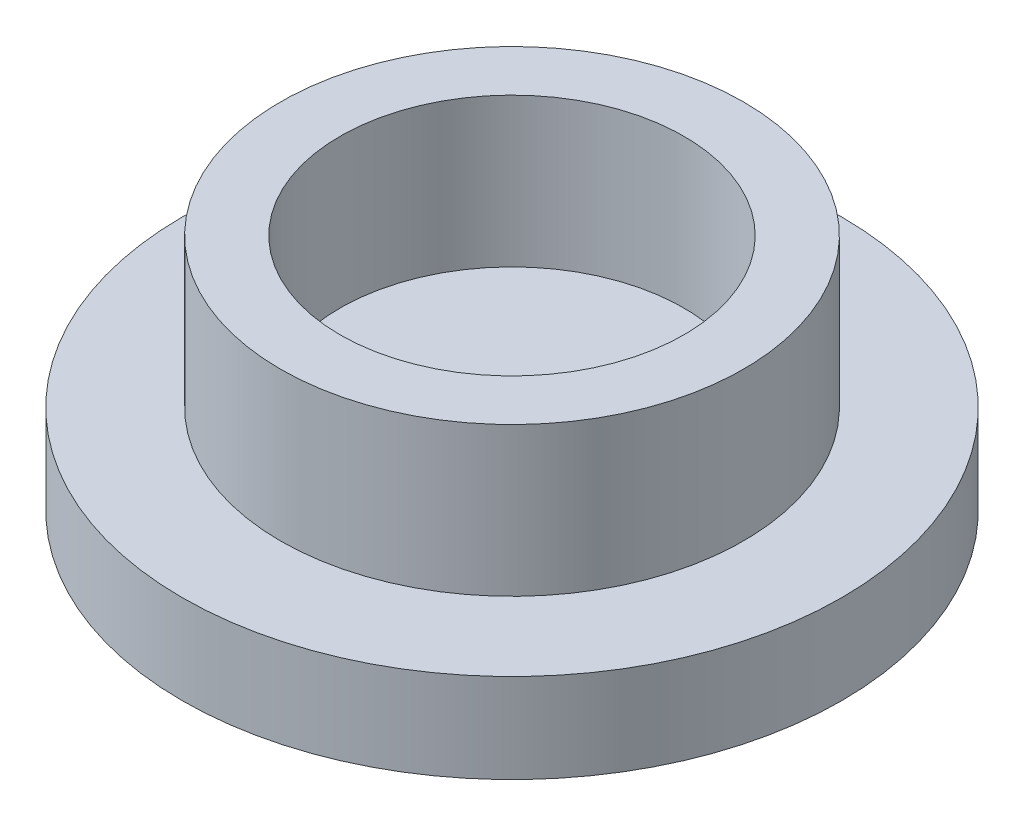
ISO-10303-21;
HEADER;
FILE_DESCRIPTION(('STEP AP214'),'2;1');
FILE_NAME('part.step','',(''),(''),'','','');
FILE_SCHEMA(('AUTOMOTIVE_DESIGN { 1 0 10303 214 1 1 1 1 }'));
ENDSEC;
DATA;
#1=APPLICATION_CONTEXT('core data for automotive mechanical design processes');
#2=APPLICATION_PROTOCOL_DEFINITION('international standard','automotive_design',2000,#1);
#3=PRODUCT_CONTEXT('',#1,'mechanical');
#4=PRODUCT('Part','Part','',(#3));
#5=PRODUCT_RELATED_PRODUCT_CATEGORY('part','',(#4));
#6=PRODUCT_DEFINITION_FORMATION('','',#4);
#7=PRODUCT_DEFINITION_CONTEXT('part definition',#1,'design');
#8=PRODUCT_DEFINITION('design','',#6,#7);
#9=PRODUCT_DEFINITION_SHAPE('','',#8);
#10=(LENGTH_UNIT() NAMED_UNIT(*) SI_UNIT(.MILLI.,.METRE.));
#11=(NAMED_UNIT(*) PLANE_ANGLE_UNIT() SI_UNIT($,.RADIAN.));
#12=(NAMED_UNIT(*) SI_UNIT($,.STERADIAN.) SOLID_ANGLE_UNIT());
#13=UNCERTAINTY_MEASURE_WITH_UNIT(LENGTH_MEASURE(1.E-05),#10,'distance_accuracy_value','');
#14=(GEOMETRIC_REPRESENTATION_CONTEXT(3) GLOBAL_UNCERTAINTY_ASSIGNED_CONTEXT((#13)) GLOBAL_UNIT_ASSIGNED_CONTEXT((#10,
#11,#12)) REPRESENTATION_CONTEXT('',''));
#15=CARTESIAN_POINT('',(0.,0.,0.));
#16=DIRECTION('',(0.,0.,1.));
#17=DIRECTION('',(1.,0.,0.));
#18=AXIS2_PLACEMENT_3D('',#15,#16,#17);
#19=CARTESIAN_POINT('',(0.,3.,0.));
#20=DIRECTION('',(0.,-1.,0.));
#21=DIRECTION('',(0.,0.,-1.));
#22=AXIS2_PLACEMENT_3D('',#19,#20,#21);
#23=CYLINDRICAL_SURFACE('',#22,11.08);
#24=CARTESIAN_POINT('',(0.,3.,0.));
#25=DIRECTION('',(0.,1.,0.));
#26=DIRECTION('',(0.,0.,1.));
#27=AXIS2_PLACEMENT_3D('',#24,#25,#26);
#28=CIRCLE('',#27,11.08);
#29=CARTESIAN_POINT('',(0.,3.,11.08));
#30=VERTEX_POINT('',#29);
#31=EDGE_CURVE('E37',#30,#30,#28,.T.);
#32=ORIENTED_EDGE('',*,*,#31,.F.);
#33=EDGE_LOOP('',(#32));
#34=FACE_BOUND('',#33,.T.);
#35=CARTESIAN_POINT('',(0.,0.,0.));
#36=DIRECTION('',(0.,1.,0.));
#37=DIRECTION('',(0.,0.,1.));
#38=AXIS2_PLACEMENT_3D('',#35,#36,#37);
#39=CIRCLE('',#38,11.08);
#40=CARTESIAN_POINT('',(0.,0.,11.08));
#41=VERTEX_POINT('',#40);
#42=EDGE_CURVE('E41',#41,#41,#39,.T.);
#43=ORIENTED_EDGE('',*,*,#42,.T.);
#44=EDGE_LOOP('',(#43));
#45=FACE_BOUND('',#44,.T.);
#46=ADVANCED_FACE('F31',(#34,#45),#23,.T.);
#47=CARTESIAN_POINT('',(0.,3.,0.));
#48=DIRECTION('',(0.,1.,0.));
#49=DIRECTION('',(0.,0.,1.));
#50=AXIS2_PLACEMENT_3D('',#47,#48,#49);
#51=PLANE('',#50);
#52=CARTESIAN_POINT('',(0.,3.,0.));
#53=DIRECTION('',(0.,1.,0.));
#54=DIRECTION('',(0.,0.,1.));
#55=AXIS2_PLACEMENT_3D('',#52,#53,#54);
#56=CIRCLE('',#55,7.78);
#57=CARTESIAN_POINT('',(0.,3.,7.78));
#58=VERTEX_POINT('',#57);
#59=EDGE_CURVE('E48',#58,#58,#56,.T.);
#60=ORIENTED_EDGE('',*,*,#59,.F.);
#61=EDGE_LOOP('',(#60));
#62=FACE_BOUND('',#61,.T.);
#63=ORIENTED_EDGE('',*,*,#31,.T.);
#64=EDGE_LOOP('',(#63));
#65=FACE_BOUND('',#64,.T.);
#66=ADVANCED_FACE('F71',(#62,#65),#51,.T.);
#67=CARTESIAN_POINT('',(0.,0.,0.));
#68=DIRECTION('',(0.,1.,0.));
#69=DIRECTION('',(0.,0.,1.));
#70=AXIS2_PLACEMENT_3D('',#67,#68,#69);
#71=PLANE('',#70);
#72=ORIENTED_EDGE('',*,*,#42,.F.);
#73=EDGE_LOOP('',(#72));
#74=FACE_BOUND('',#73,.T.);
#75=ADVANCED_FACE('F62',(#74),#71,.F.);
#76=CARTESIAN_POINT('',(0.,8.,0.));
#77=DIRECTION('',(0.,1.,0.));
#78=DIRECTION('',(0.,0.,1.));
#79=AXIS2_PLACEMENT_3D('',#76,#77,#78);
#80=PLANE('',#79);
#81=CARTESIAN_POINT('',(0.,8.,0.));
#82=DIRECTION('',(0.,1.,0.));
#83=DIRECTION('',(0.,0.,1.));
#84=AXIS2_PLACEMENT_3D('',#81,#82,#83);
#85=CIRCLE('',#84,7.78);
#86=CARTESIAN_POINT('',(0.,8.,7.78));
#87=VERTEX_POINT('',#86);
#88=EDGE_CURVE('E46',#87,#87,#85,.T.);
#89=ORIENTED_EDGE('',*,*,#88,.T.);
#90=EDGE_LOOP('',(#89));
#91=FACE_BOUND('',#90,.T.);
#92=CARTESIAN_POINT('',(0.,8.,0.));
#93=DIRECTION('',(0.,1.,0.));
#94=DIRECTION('',(0.,0.,1.));
#95=AXIS2_PLACEMENT_3D('',#92,#93,#94);
#96=CIRCLE('',#95,5.78);
#97=CARTESIAN_POINT('',(0.,8.,5.78));
#98=VERTEX_POINT('',#97);
#99=EDGE_CURVE('E51',#98,#98,#96,.T.);
#100=ORIENTED_EDGE('',*,*,#99,.F.);
#101=EDGE_LOOP('',(#100));
#102=FACE_BOUND('',#101,.T.);
#103=ADVANCED_FACE('F59',(#91,#102),#80,.T.);
#104=CARTESIAN_POINT('',(0.,8.,0.));
#105=DIRECTION('',(0.,-1.,0.));
#106=DIRECTION('',(0.,0.,-1.));
#107=AXIS2_PLACEMENT_3D('',#104,#105,#106);
#108=CYLINDRICAL_SURFACE('',#107,7.78);
#109=ORIENTED_EDGE('',*,*,#88,.F.);
#110=EDGE_LOOP('',(#109));
#111=FACE_BOUND('',#110,.T.);
#112=ORIENTED_EDGE('',*,*,#59,.T.);
#113=EDGE_LOOP('',(#112));
#114=FACE_BOUND('',#113,.T.);
#115=ADVANCED_FACE('F61',(#111,#114),#108,.T.);
#116=CARTESIAN_POINT('',(0.,8.,0.));
#117=DIRECTION('',(0.,-1.,0.));
#118=DIRECTION('',(0.,0.,-1.));
#119=AXIS2_PLACEMENT_3D('',#116,#117,#118);
#120=CYLINDRICAL_SURFACE('',#119,5.78);
#121=ORIENTED_EDGE('',*,*,#99,.T.);
#122=EDGE_LOOP('',(#121));
#123=FACE_BOUND('',#122,.T.);
#124=CARTESIAN_POINT('',(0.,3.,0.));
#125=DIRECTION('',(0.,1.,0.));
#126=DIRECTION('',(0.,0.,1.));
#127=AXIS2_PLACEMENT_3D('',#124,#125,#126);
#128=CIRCLE('',#127,5.78);
#129=CARTESIAN_POINT('',(0.,3.,5.78));
#130=VERTEX_POINT('',#129);
#131=EDGE_CURVE('E10',#130,#130,#128,.F.);
#132=ORIENTED_EDGE('',*,*,#131,.T.);
#133=EDGE_LOOP('',(#132));
#134=FACE_BOUND('',#133,.T.);
#135=ADVANCED_FACE('F57',(#123,#134),#120,.F.);
#136=ORIENTED_EDGE('',*,*,#131,.F.);
#137=EDGE_LOOP('',(#136));
#138=FACE_BOUND('',#137,.T.);
#139=ADVANCED_FACE('F81',(#138),#51,.T.);
#140=CLOSED_SHELL('',(#46,#66,#75,#103,#115,#135,#139));
#141=MANIFOLD_SOLID_BREP('B2',#140);
#142=ADVANCED_BREP_SHAPE_REPRESENTATION('',(#18,#141),#14);
#143=SHAPE_DEFINITION_REPRESENTATION(#9,#142);
ENDSEC;
END-ISO-10303-21;
